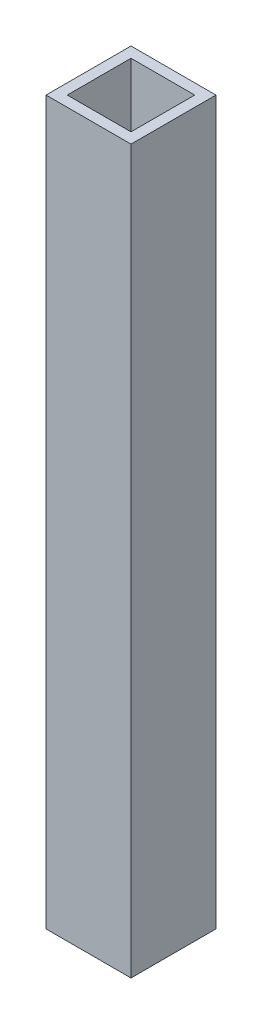
ISO-10303-21;
HEADER;
FILE_DESCRIPTION(('STEP AP214'),'2;1');
FILE_NAME('part.step','',(''),(''),'','','');
FILE_SCHEMA(('AUTOMOTIVE_DESIGN { 1 0 10303 214 1 1 1 1 }'));
ENDSEC;
DATA;
#1=APPLICATION_CONTEXT('core data for automotive mechanical design processes');
#2=APPLICATION_PROTOCOL_DEFINITION('international standard','automotive_design',2000,#1);
#3=PRODUCT_CONTEXT('',#1,'mechanical');
#4=PRODUCT('Part','Part','',(#3));
#5=PRODUCT_RELATED_PRODUCT_CATEGORY('part','',(#4));
#6=PRODUCT_DEFINITION_FORMATION('','',#4);
#7=PRODUCT_DEFINITION_CONTEXT('part definition',#1,'design');
#8=PRODUCT_DEFINITION('design','',#6,#7);
#9=PRODUCT_DEFINITION_SHAPE('','',#8);
#10=(LENGTH_UNIT() NAMED_UNIT(*) SI_UNIT(.MILLI.,.METRE.));
#11=(NAMED_UNIT(*) PLANE_ANGLE_UNIT() SI_UNIT($,.RADIAN.));
#12=(NAMED_UNIT(*) SI_UNIT($,.STERADIAN.) SOLID_ANGLE_UNIT());
#13=UNCERTAINTY_MEASURE_WITH_UNIT(LENGTH_MEASURE(1.E-05),#10,'distance_accuracy_value','');
#14=(GEOMETRIC_REPRESENTATION_CONTEXT(3) GLOBAL_UNCERTAINTY_ASSIGNED_CONTEXT((#13)) GLOBAL_UNIT_ASSIGNED_CONTEXT((#10,
#11,#12)) REPRESENTATION_CONTEXT('',''));
#15=CARTESIAN_POINT('',(0.,0.,0.));
#16=DIRECTION('',(0.,0.,1.));
#17=DIRECTION('',(1.,0.,0.));
#18=AXIS2_PLACEMENT_3D('',#15,#16,#17);
#19=CARTESIAN_POINT('',(-171.45,266.7,-3.84401965253075));
#20=DIRECTION('',(1.,0.,0.));
#21=DIRECTION('',(0.,0.,-1.));
#22=AXIS2_PLACEMENT_3D('',#19,#20,#21);
#23=PLANE('',#22);
#24=DIRECTION('',(0.,0.,1.));
#25=VECTOR('',#24,1.);
#26=CARTESIAN_POINT('',(-171.45,-165.1,-3.84401965253075));
#27=LINE('',#26,#25);
#28=CARTESIAN_POINT('',(-171.45,-165.1,6.35));
#29=VERTEX_POINT('',#28);
#30=CARTESIAN_POINT('',(-171.45,-165.1,44.45));
#31=VERTEX_POINT('',#30);
#32=EDGE_CURVE('E157',#29,#31,#27,.T.);
#33=ORIENTED_EDGE('',*,*,#32,.T.);
#34=DIRECTION('',(0.,-1.,0.));
#35=VECTOR('',#34,1.);
#36=CARTESIAN_POINT('',(-171.45,266.7,44.45));
#37=LINE('',#36,#35);
#38=CARTESIAN_POINT('',(-171.45,266.7,44.45));
#39=VERTEX_POINT('',#38);
#40=EDGE_CURVE('E9',#39,#31,#37,.T.);
#41=ORIENTED_EDGE('',*,*,#40,.F.);
#42=DIRECTION('',(0.,0.,1.));
#43=VECTOR('',#42,1.);
#44=CARTESIAN_POINT('',(-171.45,266.7,-3.84401965253075));
#45=LINE('',#44,#43);
#46=CARTESIAN_POINT('',(-171.45,266.7,6.35));
#47=VERTEX_POINT('',#46);
#48=EDGE_CURVE('E117',#47,#39,#45,.T.);
#49=ORIENTED_EDGE('',*,*,#48,.F.);
#50=DIRECTION('',(0.,-1.,0.));
#51=VECTOR('',#50,1.);
#52=CARTESIAN_POINT('',(-171.45,266.7,6.35));
#53=LINE('',#52,#51);
#54=EDGE_CURVE('E39',#47,#29,#53,.T.);
#55=ORIENTED_EDGE('',*,*,#54,.T.);
#56=EDGE_LOOP('',(#33,#41,#49,#55));
#57=FACE_BOUND('',#56,.T.);
#58=ADVANCED_FACE('F14',(#57),#23,.F.);
#59=CARTESIAN_POINT('',(-173.697840166092,266.7,44.45));
#60=DIRECTION('',(0.,0.,1.));
#61=DIRECTION('',(1.,0.,0.));
#62=AXIS2_PLACEMENT_3D('',#59,#60,#61);
#63=PLANE('',#62);
#64=DIRECTION('',(-1.,0.,0.));
#65=VECTOR('',#64,1.);
#66=CARTESIAN_POINT('',(-173.697840166092,-165.1,44.45));
#67=LINE('',#66,#65);
#68=CARTESIAN_POINT('',(-209.55,-165.1,44.45));
#69=VERTEX_POINT('',#68);
#70=EDGE_CURVE('E124',#31,#69,#67,.T.);
#71=ORIENTED_EDGE('',*,*,#70,.T.);
#72=DIRECTION('',(0.,-1.,0.));
#73=VECTOR('',#72,1.);
#74=CARTESIAN_POINT('',(-209.55,266.7,44.45));
#75=LINE('',#74,#73);
#76=CARTESIAN_POINT('',(-209.55,266.7,44.45));
#77=VERTEX_POINT('',#76);
#78=EDGE_CURVE('E25',#77,#69,#75,.T.);
#79=ORIENTED_EDGE('',*,*,#78,.F.);
#80=DIRECTION('',(-1.,0.,0.));
#81=VECTOR('',#80,1.);
#82=CARTESIAN_POINT('',(-173.697840166092,266.7,44.45));
#83=LINE('',#82,#81);
#84=EDGE_CURVE('E111',#39,#77,#83,.T.);
#85=ORIENTED_EDGE('',*,*,#84,.F.);
#86=ORIENTED_EDGE('',*,*,#40,.T.);
#87=EDGE_LOOP('',(#71,#79,#85,#86));
#88=FACE_BOUND('',#87,.T.);
#89=ADVANCED_FACE('F123',(#88),#63,.F.);
#90=CARTESIAN_POINT('',(-209.55,266.7,-3.84401965253073));
#91=DIRECTION('',(1.,0.,0.));
#92=DIRECTION('',(0.,0.,-1.));
#93=AXIS2_PLACEMENT_3D('',#90,#91,#92);
#94=PLANE('',#93);
#95=DIRECTION('',(0.,0.,1.));
#96=VECTOR('',#95,1.);
#97=CARTESIAN_POINT('',(-209.55,-165.1,-3.84401965253073));
#98=LINE('',#97,#96);
#99=CARTESIAN_POINT('',(-209.55,-165.1,6.35));
#100=VERTEX_POINT('',#99);
#101=EDGE_CURVE('E162',#100,#69,#98,.T.);
#102=ORIENTED_EDGE('',*,*,#101,.F.);
#103=DIRECTION('',(0.,-1.,0.));
#104=VECTOR('',#103,1.);
#105=CARTESIAN_POINT('',(-209.55,266.7,6.35));
#106=LINE('',#105,#104);
#107=CARTESIAN_POINT('',(-209.55,266.7,6.35));
#108=VERTEX_POINT('',#107);
#109=EDGE_CURVE('E73',#108,#100,#106,.T.);
#110=ORIENTED_EDGE('',*,*,#109,.F.);
#111=DIRECTION('',(0.,0.,1.));
#112=VECTOR('',#111,1.);
#113=CARTESIAN_POINT('',(-209.55,266.7,-3.84401965253073));
#114=LINE('',#113,#112);
#115=EDGE_CURVE('E116',#108,#77,#114,.T.);
#116=ORIENTED_EDGE('',*,*,#115,.T.);
#117=ORIENTED_EDGE('',*,*,#78,.T.);
#118=EDGE_LOOP('',(#102,#110,#116,#117));
#119=FACE_BOUND('',#118,.T.);
#120=ADVANCED_FACE('F129',(#119),#94,.T.);
#121=CARTESIAN_POINT('',(-190.5,266.7,50.8));
#122=DIRECTION('',(0.,0.,1.));
#123=DIRECTION('',(1.,0.,0.));
#124=AXIS2_PLACEMENT_3D('',#121,#122,#123);
#125=PLANE('',#124);
#126=DIRECTION('',(-1.,0.,0.));
#127=VECTOR('',#126,1.);
#128=CARTESIAN_POINT('',(-190.5,-165.1,50.8));
#129=LINE('',#128,#127);
#130=CARTESIAN_POINT('',(-165.1,-165.1,50.8));
#131=VERTEX_POINT('',#130);
#132=CARTESIAN_POINT('',(-215.9,-165.1,50.8));
#133=VERTEX_POINT('',#132);
#134=EDGE_CURVE('E141',#131,#133,#129,.T.);
#135=ORIENTED_EDGE('',*,*,#134,.F.);
#136=DIRECTION('',(0.,-1.,0.));
#137=VECTOR('',#136,1.);
#138=CARTESIAN_POINT('',(-165.1,266.7,50.8));
#139=LINE('',#138,#137);
#140=CARTESIAN_POINT('',(-165.1,266.7,50.8));
#141=VERTEX_POINT('',#140);
#142=EDGE_CURVE('E18',#141,#131,#139,.T.);
#143=ORIENTED_EDGE('',*,*,#142,.F.);
#144=DIRECTION('',(-1.,0.,0.));
#145=VECTOR('',#144,1.);
#146=CARTESIAN_POINT('',(-190.5,266.7,50.8));
#147=LINE('',#146,#145);
#148=CARTESIAN_POINT('',(-215.9,266.7,50.8));
#149=VERTEX_POINT('',#148);
#150=EDGE_CURVE('E168',#141,#149,#147,.T.);
#151=ORIENTED_EDGE('',*,*,#150,.T.);
#152=DIRECTION('',(0.,-1.,0.));
#153=VECTOR('',#152,1.);
#154=CARTESIAN_POINT('',(-215.9,266.7,50.8));
#155=LINE('',#154,#153);
#156=EDGE_CURVE('E137',#149,#133,#155,.T.);
#157=ORIENTED_EDGE('',*,*,#156,.T.);
#158=EDGE_LOOP('',(#135,#143,#151,#157));
#159=FACE_BOUND('',#158,.T.);
#160=ADVANCED_FACE('F16',(#159),#125,.T.);
#161=CARTESIAN_POINT('',(-165.1,266.7,2082.8));
#162=DIRECTION('',(-1.,0.,0.));
#163=DIRECTION('',(0.,0.,1.));
#164=AXIS2_PLACEMENT_3D('',#161,#162,#163);
#165=PLANE('',#164);
#166=DIRECTION('',(0.,0.,-1.));
#167=VECTOR('',#166,1.);
#168=CARTESIAN_POINT('',(-165.1,-165.1,2082.8));
#169=LINE('',#168,#167);
#170=CARTESIAN_POINT('',(-165.1,-165.1,0.));
#171=VERTEX_POINT('',#170);
#172=EDGE_CURVE('E145',#131,#171,#169,.T.);
#173=ORIENTED_EDGE('',*,*,#172,.T.);
#174=DIRECTION('',(0.,-1.,0.));
#175=VECTOR('',#174,1.);
#176=CARTESIAN_POINT('',(-165.1,266.7,0.));
#177=LINE('',#176,#175);
#178=CARTESIAN_POINT('',(-165.1,266.7,0.));
#179=VERTEX_POINT('',#178);
#180=EDGE_CURVE('E176',#179,#171,#177,.T.);
#181=ORIENTED_EDGE('',*,*,#180,.F.);
#182=DIRECTION('',(0.,0.,-1.));
#183=VECTOR('',#182,1.);
#184=CARTESIAN_POINT('',(-165.1,266.7,2082.8));
#185=LINE('',#184,#183);
#186=EDGE_CURVE('E188',#141,#179,#185,.T.);
#187=ORIENTED_EDGE('',*,*,#186,.F.);
#188=ORIENTED_EDGE('',*,*,#142,.T.);
#189=EDGE_LOOP('',(#173,#181,#187,#188));
#190=FACE_BOUND('',#189,.T.);
#191=ADVANCED_FACE('F187',(#190),#165,.F.);
#192=CARTESIAN_POINT('',(-190.5,266.7,0.));
#193=DIRECTION('',(0.,0.,-1.));
#194=DIRECTION('',(-1.,0.,0.));
#195=AXIS2_PLACEMENT_3D('',#192,#193,#194);
#196=PLANE('',#195);
#197=DIRECTION('',(1.,0.,0.));
#198=VECTOR('',#197,1.);
#199=CARTESIAN_POINT('',(-190.5,-165.1,0.));
#200=LINE('',#199,#198);
#201=CARTESIAN_POINT('',(-215.9,-165.1,0.));
#202=VERTEX_POINT('',#201);
#203=EDGE_CURVE('E149',#202,#171,#200,.T.);
#204=ORIENTED_EDGE('',*,*,#203,.F.);
#205=DIRECTION('',(0.,-1.,0.));
#206=VECTOR('',#205,1.);
#207=CARTESIAN_POINT('',(-215.9,266.7,0.));
#208=LINE('',#207,#206);
#209=CARTESIAN_POINT('',(-215.9,266.7,0.));
#210=VERTEX_POINT('',#209);
#211=EDGE_CURVE('E175',#210,#202,#208,.T.);
#212=ORIENTED_EDGE('',*,*,#211,.F.);
#213=DIRECTION('',(1.,0.,0.));
#214=VECTOR('',#213,1.);
#215=CARTESIAN_POINT('',(-190.5,266.7,0.));
#216=LINE('',#215,#214);
#217=EDGE_CURVE('E231',#210,#179,#216,.T.);
#218=ORIENTED_EDGE('',*,*,#217,.T.);
#219=ORIENTED_EDGE('',*,*,#180,.T.);
#220=EDGE_LOOP('',(#204,#212,#218,#219));
#221=FACE_BOUND('',#220,.T.);
#222=ADVANCED_FACE('F200',(#221),#196,.T.);
#223=CARTESIAN_POINT('',(-215.9,266.7,2082.8));
#224=DIRECTION('',(-1.,0.,0.));
#225=DIRECTION('',(0.,0.,1.));
#226=AXIS2_PLACEMENT_3D('',#223,#224,#225);
#227=PLANE('',#226);
#228=DIRECTION('',(0.,0.,-1.));
#229=VECTOR('',#228,1.);
#230=CARTESIAN_POINT('',(-215.9,-165.1,2082.8));
#231=LINE('',#230,#229);
#232=EDGE_CURVE('E153',#133,#202,#231,.T.);
#233=ORIENTED_EDGE('',*,*,#232,.F.);
#234=ORIENTED_EDGE('',*,*,#156,.F.);
#235=DIRECTION('',(0.,0.,-1.));
#236=VECTOR('',#235,1.);
#237=CARTESIAN_POINT('',(-215.9,266.7,2082.8));
#238=LINE('',#237,#236);
#239=EDGE_CURVE('E198',#149,#210,#238,.T.);
#240=ORIENTED_EDGE('',*,*,#239,.T.);
#241=ORIENTED_EDGE('',*,*,#211,.T.);
#242=EDGE_LOOP('',(#233,#234,#240,#241));
#243=FACE_BOUND('',#242,.T.);
#244=ADVANCED_FACE('F197',(#243),#227,.T.);
#245=CARTESIAN_POINT('',(-207.302159833908,266.7,6.35));
#246=DIRECTION('',(0.,0.,1.));
#247=DIRECTION('',(1.,0.,0.));
#248=AXIS2_PLACEMENT_3D('',#245,#246,#247);
#249=PLANE('',#248);
#250=DIRECTION('',(-1.,0.,0.));
#251=VECTOR('',#250,1.);
#252=CARTESIAN_POINT('',(-207.302159833908,-165.1,6.35));
#253=LINE('',#252,#251);
#254=EDGE_CURVE('E164',#29,#100,#253,.T.);
#255=ORIENTED_EDGE('',*,*,#254,.F.);
#256=ORIENTED_EDGE('',*,*,#54,.F.);
#257=DIRECTION('',(-1.,0.,0.));
#258=VECTOR('',#257,1.);
#259=CARTESIAN_POINT('',(-207.302159833908,266.7,6.35));
#260=LINE('',#259,#258);
#261=EDGE_CURVE('E131',#47,#108,#260,.T.);
#262=ORIENTED_EDGE('',*,*,#261,.T.);
#263=ORIENTED_EDGE('',*,*,#109,.T.);
#264=EDGE_LOOP('',(#255,#256,#262,#263));
#265=FACE_BOUND('',#264,.T.);
#266=ADVANCED_FACE('F208',(#265),#249,.T.);
#267=CARTESIAN_POINT('',(-190.5,266.7,1041.4));
#268=DIRECTION('',(0.,1.,0.));
#269=DIRECTION('',(-1.,0.,0.));
#270=AXIS2_PLACEMENT_3D('',#267,#268,#269);
#271=PLANE('',#270);
#272=ORIENTED_EDGE('',*,*,#150,.F.);
#273=ORIENTED_EDGE('',*,*,#186,.T.);
#274=ORIENTED_EDGE('',*,*,#217,.F.);
#275=ORIENTED_EDGE('',*,*,#239,.F.);
#276=EDGE_LOOP('',(#272,#273,#274,#275));
#277=FACE_BOUND('',#276,.T.);
#278=ORIENTED_EDGE('',*,*,#48,.T.);
#279=ORIENTED_EDGE('',*,*,#84,.T.);
#280=ORIENTED_EDGE('',*,*,#115,.F.);
#281=ORIENTED_EDGE('',*,*,#261,.F.);
#282=EDGE_LOOP('',(#278,#279,#280,#281));
#283=FACE_BOUND('',#282,.T.);
#284=ADVANCED_FACE('F113',(#277,#283),#271,.T.);
#285=CARTESIAN_POINT('',(-190.5,-165.1,1041.4));
#286=DIRECTION('',(0.,1.,0.));
#287=DIRECTION('',(-1.,0.,0.));
#288=AXIS2_PLACEMENT_3D('',#285,#286,#287);
#289=PLANE('',#288);
#290=ORIENTED_EDGE('',*,*,#134,.T.);
#291=ORIENTED_EDGE('',*,*,#232,.T.);
#292=ORIENTED_EDGE('',*,*,#203,.T.);
#293=ORIENTED_EDGE('',*,*,#172,.F.);
#294=EDGE_LOOP('',(#290,#291,#292,#293));
#295=FACE_BOUND('',#294,.T.);
#296=ORIENTED_EDGE('',*,*,#32,.F.);
#297=ORIENTED_EDGE('',*,*,#254,.T.);
#298=ORIENTED_EDGE('',*,*,#101,.T.);
#299=ORIENTED_EDGE('',*,*,#70,.F.);
#300=EDGE_LOOP('',(#296,#297,#298,#299));
#301=FACE_BOUND('',#300,.T.);
#302=ADVANCED_FACE('F191',(#295,#301),#289,.F.);
#303=CLOSED_SHELL('',(#58,#89,#120,#160,#191,#222,#244,#266,#284,#302));
#304=MANIFOLD_SOLID_BREP('B1',#303);
#305=ADVANCED_BREP_SHAPE_REPRESENTATION('',(#18,#304),#14);
#306=SHAPE_DEFINITION_REPRESENTATION(#9,#305);
ENDSEC;
END-ISO-10303-21;
